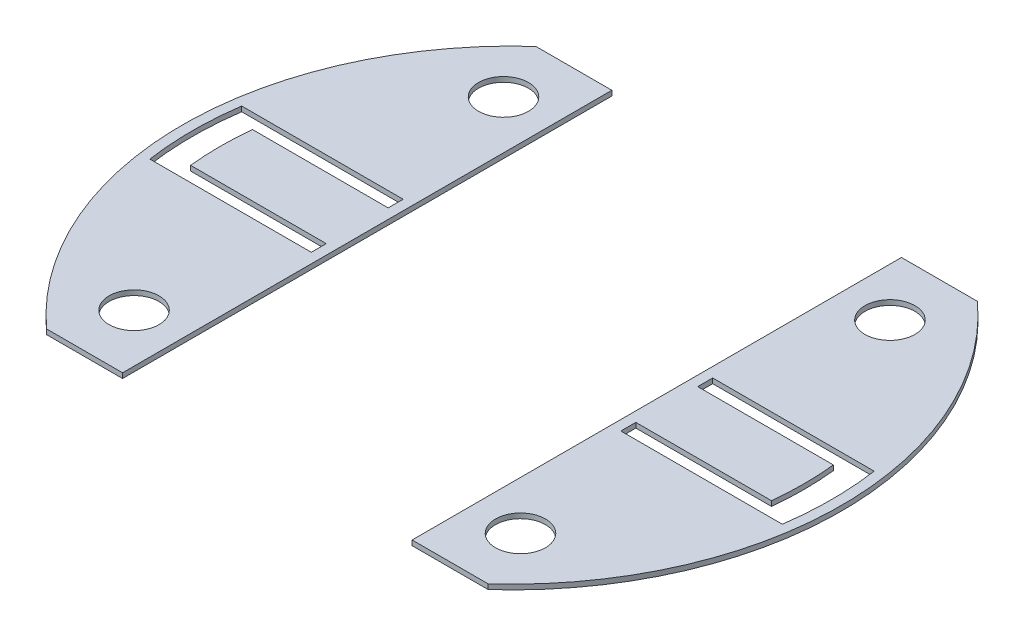
ISO-10303-21;
HEADER;
FILE_DESCRIPTION(('STEP AP214'),'2;1');
FILE_NAME('part.step','',(''),(''),'','','');
FILE_SCHEMA(('AUTOMOTIVE_DESIGN { 1 0 10303 214 1 1 1 1 }'));
ENDSEC;
DATA;
#1=APPLICATION_CONTEXT('core data for automotive mechanical design processes');
#2=APPLICATION_PROTOCOL_DEFINITION('international standard','automotive_design',2000,#1);
#3=PRODUCT_CONTEXT('',#1,'mechanical');
#4=PRODUCT('Part','Part','',(#3));
#5=PRODUCT_RELATED_PRODUCT_CATEGORY('part','',(#4));
#6=PRODUCT_DEFINITION_FORMATION('','',#4);
#7=PRODUCT_DEFINITION_CONTEXT('part definition',#1,'design');
#8=PRODUCT_DEFINITION('design','',#6,#7);
#9=PRODUCT_DEFINITION_SHAPE('','',#8);
#10=(LENGTH_UNIT() NAMED_UNIT(*) SI_UNIT(.MILLI.,.METRE.));
#11=(NAMED_UNIT(*) PLANE_ANGLE_UNIT() SI_UNIT($,.RADIAN.));
#12=(NAMED_UNIT(*) SI_UNIT($,.STERADIAN.) SOLID_ANGLE_UNIT());
#13=UNCERTAINTY_MEASURE_WITH_UNIT(LENGTH_MEASURE(1.E-05),#10,'distance_accuracy_value','');
#14=(GEOMETRIC_REPRESENTATION_CONTEXT(3) GLOBAL_UNCERTAINTY_ASSIGNED_CONTEXT((#13)) GLOBAL_UNIT_ASSIGNED_CONTEXT((#10,
#11,#12)) REPRESENTATION_CONTEXT('',''));
#15=CARTESIAN_POINT('',(0.,0.,0.));
#16=DIRECTION('',(0.,0.,1.));
#17=DIRECTION('',(1.,0.,0.));
#18=AXIS2_PLACEMENT_3D('',#15,#16,#17);
#19=CARTESIAN_POINT('',(0.,0.254,-12.446));
#20=DIRECTION('',(0.,0.,-1.));
#21=DIRECTION('',(-1.,0.,0.));
#22=AXIS2_PLACEMENT_3D('',#19,#20,#21);
#23=PLANE('',#22);
#24=DIRECTION('',(1.,0.,0.));
#25=VECTOR('',#24,1.);
#26=CARTESIAN_POINT('',(0.,0.,-12.446));
#27=LINE('',#26,#25);
#28=CARTESIAN_POINT('',(-11.2307070124725,0.,-12.446));
#29=VERTEX_POINT('',#28);
#30=CARTESIAN_POINT('',(-7.366,0.,-12.446));
#31=VERTEX_POINT('',#30);
#32=EDGE_CURVE('E194',#29,#31,#27,.T.);
#33=ORIENTED_EDGE('',*,*,#32,.F.);
#34=DIRECTION('',(0.,-1.,0.));
#35=VECTOR('',#34,1.);
#36=CARTESIAN_POINT('',(-11.2307070124725,0.254,-12.446));
#37=LINE('',#36,#35);
#38=CARTESIAN_POINT('',(-11.2307070124725,0.254,-12.446));
#39=VERTEX_POINT('',#38);
#40=EDGE_CURVE('E12',#39,#29,#37,.T.);
#41=ORIENTED_EDGE('',*,*,#40,.F.);
#42=DIRECTION('',(1.,0.,0.));
#43=VECTOR('',#42,1.);
#44=CARTESIAN_POINT('',(0.,0.254,-12.446));
#45=LINE('',#44,#43);
#46=CARTESIAN_POINT('',(-7.366,0.254,-12.446));
#47=VERTEX_POINT('',#46);
#48=EDGE_CURVE('E156',#39,#47,#45,.T.);
#49=ORIENTED_EDGE('',*,*,#48,.T.);
#50=DIRECTION('',(0.,-1.,0.));
#51=VECTOR('',#50,1.);
#52=CARTESIAN_POINT('',(-7.366,0.254,-12.446));
#53=LINE('',#52,#51);
#54=EDGE_CURVE('E66',#47,#31,#53,.T.);
#55=ORIENTED_EDGE('',*,*,#54,.T.);
#56=EDGE_LOOP('',(#33,#41,#49,#55));
#57=FACE_BOUND('',#56,.T.);
#58=ADVANCED_FACE('F47',(#57),#23,.T.);
#59=CARTESIAN_POINT('',(0.,0.254,0.));
#60=DIRECTION('',(0.,-1.,0.));
#61=DIRECTION('',(0.,0.,-1.));
#62=AXIS2_PLACEMENT_3D('',#59,#60,#61);
#63=CYLINDRICAL_SURFACE('',#62,16.764);
#64=CARTESIAN_POINT('',(0.,0.,0.));
#65=DIRECTION('',(0.,1.,0.));
#66=DIRECTION('',(0.,0.,1.));
#67=AXIS2_PLACEMENT_3D('',#64,#65,#66);
#68=CIRCLE('',#67,16.764);
#69=CARTESIAN_POINT('',(-11.2307070124725,0.,12.446));
#70=VERTEX_POINT('',#69);
#71=EDGE_CURVE('E161',#29,#70,#68,.T.);
#72=ORIENTED_EDGE('',*,*,#71,.T.);
#73=DIRECTION('',(0.,-1.,0.));
#74=VECTOR('',#73,1.);
#75=CARTESIAN_POINT('',(-11.2307070124725,0.254,12.446));
#76=LINE('',#75,#74);
#77=CARTESIAN_POINT('',(-11.2307070124725,0.254,12.446));
#78=VERTEX_POINT('',#77);
#79=EDGE_CURVE('E57',#78,#70,#76,.T.);
#80=ORIENTED_EDGE('',*,*,#79,.F.);
#81=CARTESIAN_POINT('',(0.,0.254,0.));
#82=DIRECTION('',(0.,1.,0.));
#83=DIRECTION('',(0.,0.,1.));
#84=AXIS2_PLACEMENT_3D('',#81,#82,#83);
#85=CIRCLE('',#84,16.764);
#86=EDGE_CURVE('E151',#39,#78,#85,.T.);
#87=ORIENTED_EDGE('',*,*,#86,.F.);
#88=ORIENTED_EDGE('',*,*,#40,.T.);
#89=EDGE_LOOP('',(#72,#80,#87,#88));
#90=FACE_BOUND('',#89,.T.);
#91=ADVANCED_FACE('F159',(#90),#63,.T.);
#92=CARTESIAN_POINT('',(0.,0.254,12.446));
#93=DIRECTION('',(0.,0.,-1.));
#94=DIRECTION('',(-1.,0.,0.));
#95=AXIS2_PLACEMENT_3D('',#92,#93,#94);
#96=PLANE('',#95);
#97=DIRECTION('',(1.,0.,0.));
#98=VECTOR('',#97,1.);
#99=CARTESIAN_POINT('',(0.,0.,12.446));
#100=LINE('',#99,#98);
#101=CARTESIAN_POINT('',(-7.366,0.,12.446));
#102=VERTEX_POINT('',#101);
#103=EDGE_CURVE('E191',#70,#102,#100,.T.);
#104=ORIENTED_EDGE('',*,*,#103,.T.);
#105=DIRECTION('',(0.,-1.,0.));
#106=VECTOR('',#105,1.);
#107=CARTESIAN_POINT('',(-7.366,0.254,12.446));
#108=LINE('',#107,#106);
#109=CARTESIAN_POINT('',(-7.366,0.254,12.446));
#110=VERTEX_POINT('',#109);
#111=EDGE_CURVE('E104',#110,#102,#108,.T.);
#112=ORIENTED_EDGE('',*,*,#111,.F.);
#113=DIRECTION('',(1.,0.,0.));
#114=VECTOR('',#113,1.);
#115=CARTESIAN_POINT('',(0.,0.254,12.446));
#116=LINE('',#115,#114);
#117=EDGE_CURVE('E143',#78,#110,#116,.T.);
#118=ORIENTED_EDGE('',*,*,#117,.F.);
#119=ORIENTED_EDGE('',*,*,#79,.T.);
#120=EDGE_LOOP('',(#104,#112,#118,#119));
#121=FACE_BOUND('',#120,.T.);
#122=ADVANCED_FACE('F145',(#121),#96,.F.);
#123=CARTESIAN_POINT('',(0.,0.254,0.));
#124=DIRECTION('',(0.,-1.,0.));
#125=DIRECTION('',(0.,0.,-1.));
#126=AXIS2_PLACEMENT_3D('',#123,#124,#125);
#127=CYLINDRICAL_SURFACE('',#126,14.859);
#128=CARTESIAN_POINT('',(0.,0.,0.));
#129=DIRECTION('',(0.,1.,0.));
#130=DIRECTION('',(0.,0.,1.));
#131=AXIS2_PLACEMENT_3D('',#128,#129,#130);
#132=CIRCLE('',#131,14.859);
#133=CARTESIAN_POINT('',(-14.7753133963378,0.,1.5748));
#134=VERTEX_POINT('',#133);
#135=CARTESIAN_POINT('',(-14.7753133963378,0.,-1.5748));
#136=VERTEX_POINT('',#135);
#137=EDGE_CURVE('E215',#134,#136,#132,.F.);
#138=ORIENTED_EDGE('',*,*,#137,.F.);
#139=DIRECTION('',(0.,-1.,0.));
#140=VECTOR('',#139,1.);
#141=CARTESIAN_POINT('',(-14.7753133963378,0.254,1.5748));
#142=LINE('',#141,#140);
#143=CARTESIAN_POINT('',(-14.7753133963378,0.254,1.5748));
#144=VERTEX_POINT('',#143);
#145=EDGE_CURVE('E51',#144,#134,#142,.T.);
#146=ORIENTED_EDGE('',*,*,#145,.F.);
#147=CARTESIAN_POINT('',(0.,0.254,0.));
#148=DIRECTION('',(0.,1.,0.));
#149=DIRECTION('',(0.,0.,1.));
#150=AXIS2_PLACEMENT_3D('',#147,#148,#149);
#151=CIRCLE('',#150,14.859);
#152=CARTESIAN_POINT('',(-14.7753133963378,0.254,-1.5748));
#153=VERTEX_POINT('',#152);
#154=EDGE_CURVE('E190',#144,#153,#151,.F.);
#155=ORIENTED_EDGE('',*,*,#154,.T.);
#156=DIRECTION('',(0.,-1.,0.));
#157=VECTOR('',#156,1.);
#158=CARTESIAN_POINT('',(-14.7753133963378,0.254,-1.5748));
#159=LINE('',#158,#157);
#160=EDGE_CURVE('E166',#153,#136,#159,.T.);
#161=ORIENTED_EDGE('',*,*,#160,.T.);
#162=EDGE_LOOP('',(#138,#146,#155,#161));
#163=FACE_BOUND('',#162,.T.);
#164=ADVANCED_FACE('F49',(#163),#127,.T.);
#165=CARTESIAN_POINT('',(0.,0.254,1.57479999999999));
#166=DIRECTION('',(0.,0.,1.));
#167=DIRECTION('',(1.,0.,0.));
#168=AXIS2_PLACEMENT_3D('',#165,#166,#167);
#169=PLANE('',#168);
#170=DIRECTION('',(-1.,0.,0.));
#171=VECTOR('',#170,1.);
#172=CARTESIAN_POINT('',(0.,0.,1.57479999999999));
#173=LINE('',#172,#171);
#174=CARTESIAN_POINT('',(-7.874,0.,1.5748));
#175=VERTEX_POINT('',#174);
#176=EDGE_CURVE('E212',#175,#134,#173,.T.);
#177=ORIENTED_EDGE('',*,*,#176,.F.);
#178=DIRECTION('',(0.,-1.,0.));
#179=VECTOR('',#178,1.);
#180=CARTESIAN_POINT('',(-7.874,0.254,1.5748));
#181=LINE('',#180,#179);
#182=CARTESIAN_POINT('',(-7.874,0.254,1.5748));
#183=VERTEX_POINT('',#182);
#184=EDGE_CURVE('E179',#183,#175,#181,.T.);
#185=ORIENTED_EDGE('',*,*,#184,.F.);
#186=DIRECTION('',(-1.,0.,0.));
#187=VECTOR('',#186,1.);
#188=CARTESIAN_POINT('',(0.,0.254,1.57479999999999));
#189=LINE('',#188,#187);
#190=EDGE_CURVE('E235',#183,#144,#189,.T.);
#191=ORIENTED_EDGE('',*,*,#190,.T.);
#192=ORIENTED_EDGE('',*,*,#145,.T.);
#193=EDGE_LOOP('',(#177,#185,#191,#192));
#194=FACE_BOUND('',#193,.T.);
#195=ADVANCED_FACE('F269',(#194),#169,.T.);
#196=CARTESIAN_POINT('',(-7.874,0.254,0.));
#197=DIRECTION('',(1.,0.,0.));
#198=DIRECTION('',(0.,0.,-1.));
#199=AXIS2_PLACEMENT_3D('',#196,#197,#198);
#200=PLANE('',#199);
#201=DIRECTION('',(0.,0.,1.));
#202=VECTOR('',#201,1.);
#203=CARTESIAN_POINT('',(-7.874,0.,0.));
#204=LINE('',#203,#202);
#205=CARTESIAN_POINT('',(-7.874,0.,2.3368));
#206=VERTEX_POINT('',#205);
#207=EDGE_CURVE('E210',#175,#206,#204,.T.);
#208=ORIENTED_EDGE('',*,*,#207,.T.);
#209=DIRECTION('',(0.,-1.,0.));
#210=VECTOR('',#209,1.);
#211=CARTESIAN_POINT('',(-7.874,0.254,2.3368));
#212=LINE('',#211,#210);
#213=CARTESIAN_POINT('',(-7.874,0.254,2.3368));
#214=VERTEX_POINT('',#213);
#215=EDGE_CURVE('E177',#214,#206,#212,.T.);
#216=ORIENTED_EDGE('',*,*,#215,.F.);
#217=DIRECTION('',(0.,0.,1.));
#218=VECTOR('',#217,1.);
#219=CARTESIAN_POINT('',(-7.874,0.254,0.));
#220=LINE('',#219,#218);
#221=EDGE_CURVE('E233',#183,#214,#220,.T.);
#222=ORIENTED_EDGE('',*,*,#221,.F.);
#223=ORIENTED_EDGE('',*,*,#184,.T.);
#224=EDGE_LOOP('',(#208,#216,#222,#223));
#225=FACE_BOUND('',#224,.T.);
#226=ADVANCED_FACE('F271',(#225),#200,.F.);
#227=CARTESIAN_POINT('',(0.,0.254,2.3368));
#228=DIRECTION('',(0.,0.,1.));
#229=DIRECTION('',(1.,0.,0.));
#230=AXIS2_PLACEMENT_3D('',#227,#228,#229);
#231=PLANE('',#230);
#232=DIRECTION('',(-1.,0.,0.));
#233=VECTOR('',#232,1.);
#234=CARTESIAN_POINT('',(0.,0.,2.3368));
#235=LINE('',#234,#233);
#236=CARTESIAN_POINT('',(-16.0871657466441,0.,2.3368));
#237=VERTEX_POINT('',#236);
#238=EDGE_CURVE('E207',#206,#237,#235,.T.);
#239=ORIENTED_EDGE('',*,*,#238,.T.);
#240=DIRECTION('',(0.,-1.,0.));
#241=VECTOR('',#240,1.);
#242=CARTESIAN_POINT('',(-16.0871657466441,0.254,2.3368));
#243=LINE('',#242,#241);
#244=CARTESIAN_POINT('',(-16.0871657466441,0.254,2.3368));
#245=VERTEX_POINT('',#244);
#246=EDGE_CURVE('E175',#245,#237,#243,.T.);
#247=ORIENTED_EDGE('',*,*,#246,.F.);
#248=DIRECTION('',(-1.,0.,0.));
#249=VECTOR('',#248,1.);
#250=CARTESIAN_POINT('',(0.,0.254,2.3368));
#251=LINE('',#250,#249);
#252=EDGE_CURVE('E231',#214,#245,#251,.T.);
#253=ORIENTED_EDGE('',*,*,#252,.F.);
#254=ORIENTED_EDGE('',*,*,#215,.T.);
#255=EDGE_LOOP('',(#239,#247,#253,#254));
#256=FACE_BOUND('',#255,.T.);
#257=ADVANCED_FACE('F277',(#256),#231,.F.);
#258=CARTESIAN_POINT('',(0.,0.254,0.));
#259=DIRECTION('',(0.,-1.,0.));
#260=DIRECTION('',(0.,0.,-1.));
#261=AXIS2_PLACEMENT_3D('',#258,#259,#260);
#262=CYLINDRICAL_SURFACE('',#261,16.256);
#263=CARTESIAN_POINT('',(0.,0.,0.));
#264=DIRECTION('',(0.,1.,0.));
#265=DIRECTION('',(0.,0.,1.));
#266=AXIS2_PLACEMENT_3D('',#263,#264,#265);
#267=CIRCLE('',#266,16.256);
#268=CARTESIAN_POINT('',(-16.0871657466441,0.,-2.33679999999999));
#269=VERTEX_POINT('',#268);
#270=EDGE_CURVE('E204',#269,#237,#267,.T.);
#271=ORIENTED_EDGE('',*,*,#270,.F.);
#272=DIRECTION('',(0.,-1.,0.));
#273=VECTOR('',#272,1.);
#274=CARTESIAN_POINT('',(-16.0871657466441,0.254,-2.33679999999999));
#275=LINE('',#274,#273);
#276=CARTESIAN_POINT('',(-16.0871657466441,0.254,-2.33679999999999));
#277=VERTEX_POINT('',#276);
#278=EDGE_CURVE('E173',#277,#269,#275,.T.);
#279=ORIENTED_EDGE('',*,*,#278,.F.);
#280=CARTESIAN_POINT('',(0.,0.254,0.));
#281=DIRECTION('',(0.,1.,0.));
#282=DIRECTION('',(0.,0.,1.));
#283=AXIS2_PLACEMENT_3D('',#280,#281,#282);
#284=CIRCLE('',#283,16.256);
#285=EDGE_CURVE('E228',#277,#245,#284,.T.);
#286=ORIENTED_EDGE('',*,*,#285,.T.);
#287=ORIENTED_EDGE('',*,*,#246,.T.);
#288=EDGE_LOOP('',(#271,#279,#286,#287));
#289=FACE_BOUND('',#288,.T.);
#290=ADVANCED_FACE('F281',(#289),#262,.F.);
#291=CARTESIAN_POINT('',(0.,0.254,-2.3368));
#292=DIRECTION('',(0.,0.,1.));
#293=DIRECTION('',(1.,0.,0.));
#294=AXIS2_PLACEMENT_3D('',#291,#292,#293);
#295=PLANE('',#294);
#296=DIRECTION('',(-1.,0.,0.));
#297=VECTOR('',#296,1.);
#298=CARTESIAN_POINT('',(0.,0.,-2.3368));
#299=LINE('',#298,#297);
#300=CARTESIAN_POINT('',(-7.874,0.,-2.3368));
#301=VERTEX_POINT('',#300);
#302=EDGE_CURVE('E201',#301,#269,#299,.T.);
#303=ORIENTED_EDGE('',*,*,#302,.F.);
#304=DIRECTION('',(0.,-1.,0.));
#305=VECTOR('',#304,1.);
#306=CARTESIAN_POINT('',(-7.874,0.254,-2.3368));
#307=LINE('',#306,#305);
#308=CARTESIAN_POINT('',(-7.874,0.254,-2.3368));
#309=VERTEX_POINT('',#308);
#310=EDGE_CURVE('E171',#309,#301,#307,.T.);
#311=ORIENTED_EDGE('',*,*,#310,.F.);
#312=DIRECTION('',(-1.,0.,0.));
#313=VECTOR('',#312,1.);
#314=CARTESIAN_POINT('',(0.,0.254,-2.3368));
#315=LINE('',#314,#313);
#316=EDGE_CURVE('E225',#309,#277,#315,.T.);
#317=ORIENTED_EDGE('',*,*,#316,.T.);
#318=ORIENTED_EDGE('',*,*,#278,.T.);
#319=EDGE_LOOP('',(#303,#311,#317,#318));
#320=FACE_BOUND('',#319,.T.);
#321=ADVANCED_FACE('F284',(#320),#295,.T.);
#322=CARTESIAN_POINT('',(-7.874,0.254,0.));
#323=DIRECTION('',(1.,0.,0.));
#324=DIRECTION('',(0.,0.,-1.));
#325=AXIS2_PLACEMENT_3D('',#322,#323,#324);
#326=PLANE('',#325);
#327=DIRECTION('',(0.,0.,1.));
#328=VECTOR('',#327,1.);
#329=CARTESIAN_POINT('',(-7.874,0.,0.));
#330=LINE('',#329,#328);
#331=CARTESIAN_POINT('',(-7.874,0.,-1.57479999999999));
#332=VERTEX_POINT('',#331);
#333=EDGE_CURVE('E199',#301,#332,#330,.T.);
#334=ORIENTED_EDGE('',*,*,#333,.T.);
#335=DIRECTION('',(0.,-1.,0.));
#336=VECTOR('',#335,1.);
#337=CARTESIAN_POINT('',(-7.874,0.254,-1.57479999999999));
#338=LINE('',#337,#336);
#339=CARTESIAN_POINT('',(-7.874,0.254,-1.57479999999999));
#340=VERTEX_POINT('',#339);
#341=EDGE_CURVE('E168',#340,#332,#338,.T.);
#342=ORIENTED_EDGE('',*,*,#341,.F.);
#343=DIRECTION('',(0.,0.,1.));
#344=VECTOR('',#343,1.);
#345=CARTESIAN_POINT('',(-7.874,0.254,0.));
#346=LINE('',#345,#344);
#347=EDGE_CURVE('E223',#309,#340,#346,.T.);
#348=ORIENTED_EDGE('',*,*,#347,.F.);
#349=ORIENTED_EDGE('',*,*,#310,.T.);
#350=EDGE_LOOP('',(#334,#342,#348,#349));
#351=FACE_BOUND('',#350,.T.);
#352=ADVANCED_FACE('F288',(#351),#326,.F.);
#353=CARTESIAN_POINT('',(0.,0.254,-1.57479999999999));
#354=DIRECTION('',(0.,0.,1.));
#355=DIRECTION('',(1.,0.,0.));
#356=AXIS2_PLACEMENT_3D('',#353,#354,#355);
#357=PLANE('',#356);
#358=DIRECTION('',(-1.,0.,0.));
#359=VECTOR('',#358,1.);
#360=CARTESIAN_POINT('',(0.,0.,-1.57479999999999));
#361=LINE('',#360,#359);
#362=EDGE_CURVE('E196',#332,#136,#361,.T.);
#363=ORIENTED_EDGE('',*,*,#362,.T.);
#364=ORIENTED_EDGE('',*,*,#160,.F.);
#365=DIRECTION('',(-1.,0.,0.));
#366=VECTOR('',#365,1.);
#367=CARTESIAN_POINT('',(0.,0.254,-1.57479999999999));
#368=LINE('',#367,#366);
#369=EDGE_CURVE('E221',#340,#153,#368,.T.);
#370=ORIENTED_EDGE('',*,*,#369,.F.);
#371=ORIENTED_EDGE('',*,*,#341,.T.);
#372=EDGE_LOOP('',(#363,#364,#370,#371));
#373=FACE_BOUND('',#372,.T.);
#374=ADVANCED_FACE('F292',(#373),#357,.F.);
#375=CARTESIAN_POINT('',(-7.366,0.254,0.));
#376=DIRECTION('',(1.,0.,0.));
#377=DIRECTION('',(0.,0.,-1.));
#378=AXIS2_PLACEMENT_3D('',#375,#376,#377);
#379=PLANE('',#378);
#380=DIRECTION('',(0.,0.,1.));
#381=VECTOR('',#380,1.);
#382=CARTESIAN_POINT('',(-7.366,0.,0.));
#383=LINE('',#382,#381);
#384=EDGE_CURVE('E187',#31,#102,#383,.T.);
#385=ORIENTED_EDGE('',*,*,#384,.F.);
#386=ORIENTED_EDGE('',*,*,#54,.F.);
#387=DIRECTION('',(0.,0.,1.));
#388=VECTOR('',#387,1.);
#389=CARTESIAN_POINT('',(-7.366,0.254,0.));
#390=LINE('',#389,#388);
#391=EDGE_CURVE('E150',#47,#110,#390,.T.);
#392=ORIENTED_EDGE('',*,*,#391,.T.);
#393=ORIENTED_EDGE('',*,*,#111,.T.);
#394=EDGE_LOOP('',(#385,#386,#392,#393));
#395=FACE_BOUND('',#394,.T.);
#396=ADVANCED_FACE('F262',(#395),#379,.T.);
#397=CARTESIAN_POINT('',(0.,0.254,0.));
#398=DIRECTION('',(0.,1.,0.));
#399=DIRECTION('',(0.,0.,1.));
#400=AXIS2_PLACEMENT_3D('',#397,#398,#399);
#401=PLANE('',#400);
#402=CARTESIAN_POINT('',(-9.8298,0.254,9.39799999999999));
#403=DIRECTION('',(0.,1.,0.));
#404=DIRECTION('',(0.,0.,1.));
#405=AXIS2_PLACEMENT_3D('',#402,#403,#404);
#406=CIRCLE('',#405,1.27);
#407=CARTESIAN_POINT('',(-9.8298,0.254,10.668));
#408=VERTEX_POINT('',#407);
#409=EDGE_CURVE('E244',#408,#408,#406,.T.);
#410=ORIENTED_EDGE('',*,*,#409,.F.);
#411=EDGE_LOOP('',(#410));
#412=FACE_BOUND('',#411,.T.);
#413=CARTESIAN_POINT('',(-9.8298,0.254,-9.39800000000001));
#414=DIRECTION('',(0.,1.,0.));
#415=DIRECTION('',(0.,0.,1.));
#416=AXIS2_PLACEMENT_3D('',#413,#414,#415);
#417=CIRCLE('',#416,1.27);
#418=CARTESIAN_POINT('',(-9.8298,0.254,-8.128));
#419=VERTEX_POINT('',#418);
#420=EDGE_CURVE('E238',#419,#419,#417,.T.);
#421=ORIENTED_EDGE('',*,*,#420,.F.);
#422=EDGE_LOOP('',(#421));
#423=FACE_BOUND('',#422,.T.);
#424=ORIENTED_EDGE('',*,*,#154,.F.);
#425=ORIENTED_EDGE('',*,*,#190,.F.);
#426=ORIENTED_EDGE('',*,*,#221,.T.);
#427=ORIENTED_EDGE('',*,*,#252,.T.);
#428=ORIENTED_EDGE('',*,*,#285,.F.);
#429=ORIENTED_EDGE('',*,*,#316,.F.);
#430=ORIENTED_EDGE('',*,*,#347,.T.);
#431=ORIENTED_EDGE('',*,*,#369,.T.);
#432=EDGE_LOOP('',(#424,#425,#426,#427,#428,#429,#430,#431));
#433=FACE_BOUND('',#432,.T.);
#434=ORIENTED_EDGE('',*,*,#48,.F.);
#435=ORIENTED_EDGE('',*,*,#86,.T.);
#436=ORIENTED_EDGE('',*,*,#117,.T.);
#437=ORIENTED_EDGE('',*,*,#391,.F.);
#438=EDGE_LOOP('',(#434,#435,#436,#437));
#439=FACE_BOUND('',#438,.T.);
#440=ADVANCED_FACE('F155',(#412,#423,#433,#439),#401,.T.);
#441=CARTESIAN_POINT('',(0.,0.,0.));
#442=DIRECTION('',(0.,1.,0.));
#443=DIRECTION('',(0.,0.,1.));
#444=AXIS2_PLACEMENT_3D('',#441,#442,#443);
#445=PLANE('',#444);
#446=CARTESIAN_POINT('',(-9.8298,0.,9.39799999999999));
#447=DIRECTION('',(0.,1.,0.));
#448=DIRECTION('',(0.,0.,1.));
#449=AXIS2_PLACEMENT_3D('',#446,#447,#448);
#450=CIRCLE('',#449,1.27);
#451=CARTESIAN_POINT('',(-9.8298,0.,10.668));
#452=VERTEX_POINT('',#451);
#453=EDGE_CURVE('E218',#452,#452,#450,.T.);
#454=ORIENTED_EDGE('',*,*,#453,.T.);
#455=EDGE_LOOP('',(#454));
#456=FACE_BOUND('',#455,.T.);
#457=CARTESIAN_POINT('',(-9.8298,0.,-9.39800000000001));
#458=DIRECTION('',(0.,1.,0.));
#459=DIRECTION('',(0.,0.,1.));
#460=AXIS2_PLACEMENT_3D('',#457,#458,#459);
#461=CIRCLE('',#460,1.27);
#462=CARTESIAN_POINT('',(-9.8298,0.,-8.128));
#463=VERTEX_POINT('',#462);
#464=EDGE_CURVE('E241',#463,#463,#461,.T.);
#465=ORIENTED_EDGE('',*,*,#464,.T.);
#466=EDGE_LOOP('',(#465));
#467=FACE_BOUND('',#466,.T.);
#468=ORIENTED_EDGE('',*,*,#137,.T.);
#469=ORIENTED_EDGE('',*,*,#362,.F.);
#470=ORIENTED_EDGE('',*,*,#333,.F.);
#471=ORIENTED_EDGE('',*,*,#302,.T.);
#472=ORIENTED_EDGE('',*,*,#270,.T.);
#473=ORIENTED_EDGE('',*,*,#238,.F.);
#474=ORIENTED_EDGE('',*,*,#207,.F.);
#475=ORIENTED_EDGE('',*,*,#176,.T.);
#476=EDGE_LOOP('',(#468,#469,#470,#471,#472,#473,#474,#475));
#477=FACE_BOUND('',#476,.T.);
#478=ORIENTED_EDGE('',*,*,#32,.T.);
#479=ORIENTED_EDGE('',*,*,#384,.T.);
#480=ORIENTED_EDGE('',*,*,#103,.F.);
#481=ORIENTED_EDGE('',*,*,#71,.F.);
#482=EDGE_LOOP('',(#478,#479,#480,#481));
#483=FACE_BOUND('',#482,.T.);
#484=ADVANCED_FACE('F250',(#456,#467,#477,#483),#445,.F.);
#485=CARTESIAN_POINT('',(-9.8298,0.,-9.39800000000001));
#486=DIRECTION('',(0.,1.,0.));
#487=DIRECTION('',(0.,0.,1.));
#488=AXIS2_PLACEMENT_3D('',#485,#486,#487);
#489=CYLINDRICAL_SURFACE('',#488,1.27);
#490=ORIENTED_EDGE('',*,*,#464,.F.);
#491=EDGE_LOOP('',(#490));
#492=FACE_BOUND('',#491,.T.);
#493=ORIENTED_EDGE('',*,*,#420,.T.);
#494=EDGE_LOOP('',(#493));
#495=FACE_BOUND('',#494,.T.);
#496=ADVANCED_FACE('F256',(#492,#495),#489,.F.);
#497=CARTESIAN_POINT('',(-9.8298,0.,9.39799999999999));
#498=DIRECTION('',(0.,1.,0.));
#499=DIRECTION('',(0.,0.,1.));
#500=AXIS2_PLACEMENT_3D('',#497,#498,#499);
#501=CYLINDRICAL_SURFACE('',#500,1.27);
#502=ORIENTED_EDGE('',*,*,#453,.F.);
#503=EDGE_LOOP('',(#502));
#504=FACE_BOUND('',#503,.T.);
#505=ORIENTED_EDGE('',*,*,#409,.T.);
#506=EDGE_LOOP('',(#505));
#507=FACE_BOUND('',#506,.T.);
#508=ADVANCED_FACE('F253',(#504,#507),#501,.F.);
#509=CLOSED_SHELL('',(#58,#91,#122,#164,#195,#226,#257,#290,#321,#352,#374,#396,#440,#484,#496,#508));
#510=MANIFOLD_SOLID_BREP('B2',#509);
#511=CARTESIAN_POINT('',(0.,0.254,1.5748));
#512=DIRECTION('',(0.,0.,-1.));
#513=DIRECTION('',(-1.,0.,0.));
#514=AXIS2_PLACEMENT_3D('',#511,#512,#513);
#515=PLANE('',#514);
#516=DIRECTION('',(1.,0.,0.));
#517=VECTOR('',#516,1.);
#518=CARTESIAN_POINT('',(0.,0.,1.5748));
#519=LINE('',#518,#517);
#520=CARTESIAN_POINT('',(7.874,0.,1.5748));
#521=VERTEX_POINT('',#520);
#522=CARTESIAN_POINT('',(14.7753133963378,0.,1.5748));
#523=VERTEX_POINT('',#522);
#524=EDGE_CURVE('E560',#521,#523,#519,.T.);
#525=ORIENTED_EDGE('',*,*,#524,.T.);
#526=DIRECTION('',(0.,-1.,0.));
#527=VECTOR('',#526,1.);
#528=CARTESIAN_POINT('',(14.7753133963378,0.254,1.5748));
#529=LINE('',#528,#527);
#530=CARTESIAN_POINT('',(14.7753133963378,0.254,1.5748));
#531=VERTEX_POINT('',#530);
#532=EDGE_CURVE('E45',#531,#523,#529,.T.);
#533=ORIENTED_EDGE('',*,*,#532,.F.);
#534=DIRECTION('',(1.,0.,0.));
#535=VECTOR('',#534,1.);
#536=CARTESIAN_POINT('',(0.,0.254,1.5748));
#537=LINE('',#536,#535);
#538=CARTESIAN_POINT('',(7.874,0.254,1.5748));
#539=VERTEX_POINT('',#538);
#540=EDGE_CURVE('E617',#539,#531,#537,.T.);
#541=ORIENTED_EDGE('',*,*,#540,.F.);
#542=DIRECTION('',(0.,-1.,0.));
#543=VECTOR('',#542,1.);
#544=CARTESIAN_POINT('',(7.874,0.254,1.5748));
#545=LINE('',#544,#543);
#546=EDGE_CURVE('E442',#539,#521,#545,.T.);
#547=ORIENTED_EDGE('',*,*,#546,.T.);
#548=EDGE_LOOP('',(#525,#533,#541,#547));
#549=FACE_BOUND('',#548,.T.);
#550=ADVANCED_FACE('F423',(#549),#515,.F.);
#551=CARTESIAN_POINT('',(0.,0.254,0.));
#552=DIRECTION('',(0.,-1.,0.));
#553=DIRECTION('',(0.,0.,-1.));
#554=AXIS2_PLACEMENT_3D('',#551,#552,#553);
#555=CYLINDRICAL_SURFACE('',#554,14.859);
#556=CARTESIAN_POINT('',(0.,0.,0.));
#557=DIRECTION('',(0.,1.,0.));
#558=DIRECTION('',(0.,0.,1.));
#559=AXIS2_PLACEMENT_3D('',#556,#557,#558);
#560=CIRCLE('',#559,14.859);
#561=CARTESIAN_POINT('',(14.7753133963378,0.,-1.5748));
#562=VERTEX_POINT('',#561);
#563=EDGE_CURVE('E562',#523,#562,#560,.T.);
#564=ORIENTED_EDGE('',*,*,#563,.T.);
#565=DIRECTION('',(0.,-1.,0.));
#566=VECTOR('',#565,1.);
#567=CARTESIAN_POINT('',(14.7753133963378,0.254,-1.5748));
#568=LINE('',#567,#566);
#569=CARTESIAN_POINT('',(14.7753133963378,0.254,-1.5748));
#570=VERTEX_POINT('',#569);
#571=EDGE_CURVE('E433',#570,#562,#568,.T.);
#572=ORIENTED_EDGE('',*,*,#571,.F.);
#573=CARTESIAN_POINT('',(0.,0.254,0.));
#574=DIRECTION('',(0.,1.,0.));
#575=DIRECTION('',(0.,0.,1.));
#576=AXIS2_PLACEMENT_3D('',#573,#574,#575);
#577=CIRCLE('',#576,14.859);
#578=EDGE_CURVE('E623',#531,#570,#577,.T.);
#579=ORIENTED_EDGE('',*,*,#578,.F.);
#580=ORIENTED_EDGE('',*,*,#532,.T.);
#581=EDGE_LOOP('',(#564,#572,#579,#580));
#582=FACE_BOUND('',#581,.T.);
#583=ADVANCED_FACE('F650',(#582),#555,.T.);
#584=CARTESIAN_POINT('',(0.,0.254,-1.5748));
#585=DIRECTION('',(0.,0.,-1.));
#586=DIRECTION('',(-1.,0.,0.));
#587=AXIS2_PLACEMENT_3D('',#584,#585,#586);
#588=PLANE('',#587);
#589=DIRECTION('',(1.,0.,0.));
#590=VECTOR('',#589,1.);
#591=CARTESIAN_POINT('',(0.,0.,-1.5748));
#592=LINE('',#591,#590);
#593=CARTESIAN_POINT('',(7.874,0.,-1.5748));
#594=VERTEX_POINT('',#593);
#595=EDGE_CURVE('E565',#594,#562,#592,.T.);
#596=ORIENTED_EDGE('',*,*,#595,.F.);
#597=DIRECTION('',(0.,-1.,0.));
#598=VECTOR('',#597,1.);
#599=CARTESIAN_POINT('',(7.874,0.254,-1.5748));
#600=LINE('',#599,#598);
#601=CARTESIAN_POINT('',(7.874,0.254,-1.5748));
#602=VERTEX_POINT('',#601);
#603=EDGE_CURVE('E586',#602,#594,#600,.T.);
#604=ORIENTED_EDGE('',*,*,#603,.F.);
#605=DIRECTION('',(1.,0.,0.));
#606=VECTOR('',#605,1.);
#607=CARTESIAN_POINT('',(0.,0.254,-1.5748));
#608=LINE('',#607,#606);
#609=EDGE_CURVE('E625',#602,#570,#608,.T.);
#610=ORIENTED_EDGE('',*,*,#609,.T.);
#611=ORIENTED_EDGE('',*,*,#571,.T.);
#612=EDGE_LOOP('',(#596,#604,#610,#611));
#613=FACE_BOUND('',#612,.T.);
#614=ADVANCED_FACE('F637',(#613),#588,.T.);
#615=CARTESIAN_POINT('',(7.874,0.254,0.));
#616=DIRECTION('',(1.,0.,0.));
#617=DIRECTION('',(0.,0.,-1.));
#618=AXIS2_PLACEMENT_3D('',#615,#616,#617);
#619=PLANE('',#618);
#620=DIRECTION('',(0.,0.,1.));
#621=VECTOR('',#620,1.);
#622=CARTESIAN_POINT('',(7.874,0.,0.));
#623=LINE('',#622,#621);
#624=CARTESIAN_POINT('',(7.874,0.,-2.3368));
#625=VERTEX_POINT('',#624);
#626=EDGE_CURVE('E568',#625,#594,#623,.T.);
#627=ORIENTED_EDGE('',*,*,#626,.F.);
#628=DIRECTION('',(0.,-1.,0.));
#629=VECTOR('',#628,1.);
#630=CARTESIAN_POINT('',(7.874,0.254,-2.3368));
#631=LINE('',#630,#629);
#632=CARTESIAN_POINT('',(7.874,0.254,-2.3368));
#633=VERTEX_POINT('',#632);
#634=EDGE_CURVE('E584',#633,#625,#631,.T.);
#635=ORIENTED_EDGE('',*,*,#634,.F.);
#636=DIRECTION('',(0.,0.,1.));
#637=VECTOR('',#636,1.);
#638=CARTESIAN_POINT('',(7.874,0.254,0.));
#639=LINE('',#638,#637);
#640=EDGE_CURVE('E628',#633,#602,#639,.T.);
#641=ORIENTED_EDGE('',*,*,#640,.T.);
#642=ORIENTED_EDGE('',*,*,#603,.T.);
#643=EDGE_LOOP('',(#627,#635,#641,#642));
#644=FACE_BOUND('',#643,.T.);
#645=ADVANCED_FACE('F632',(#644),#619,.T.);
#646=CARTESIAN_POINT('',(0.,0.254,-2.3368));
#647=DIRECTION('',(0.,0.,-1.));
#648=DIRECTION('',(-1.,0.,0.));
#649=AXIS2_PLACEMENT_3D('',#646,#647,#648);
#650=PLANE('',#649);
#651=DIRECTION('',(1.,0.,0.));
#652=VECTOR('',#651,1.);
#653=CARTESIAN_POINT('',(0.,0.,-2.3368));
#654=LINE('',#653,#652);
#655=CARTESIAN_POINT('',(16.0871657466441,0.,-2.3368));
#656=VERTEX_POINT('',#655);
#657=EDGE_CURVE('E571',#625,#656,#654,.T.);
#658=ORIENTED_EDGE('',*,*,#657,.T.);
#659=DIRECTION('',(0.,-1.,0.));
#660=VECTOR('',#659,1.);
#661=CARTESIAN_POINT('',(16.0871657466441,0.254,-2.3368));
#662=LINE('',#661,#660);
#663=CARTESIAN_POINT('',(16.0871657466441,0.254,-2.3368));
#664=VERTEX_POINT('',#663);
#665=EDGE_CURVE('E529',#664,#656,#662,.T.);
#666=ORIENTED_EDGE('',*,*,#665,.F.);
#667=DIRECTION('',(1.,0.,0.));
#668=VECTOR('',#667,1.);
#669=CARTESIAN_POINT('',(0.,0.254,-2.3368));
#670=LINE('',#669,#668);
#671=EDGE_CURVE('E539',#633,#664,#670,.T.);
#672=ORIENTED_EDGE('',*,*,#671,.F.);
#673=ORIENTED_EDGE('',*,*,#634,.T.);
#674=EDGE_LOOP('',(#658,#666,#672,#673));
#675=FACE_BOUND('',#674,.T.);
#676=ADVANCED_FACE('F640',(#675),#650,.F.);
#677=CARTESIAN_POINT('',(0.,0.254,0.));
#678=DIRECTION('',(0.,-1.,0.));
#679=DIRECTION('',(0.,0.,-1.));
#680=AXIS2_PLACEMENT_3D('',#677,#678,#679);
#681=CYLINDRICAL_SURFACE('',#680,16.256);
#682=CARTESIAN_POINT('',(0.,0.,0.));
#683=DIRECTION('',(0.,1.,0.));
#684=DIRECTION('',(0.,0.,1.));
#685=AXIS2_PLACEMENT_3D('',#682,#683,#684);
#686=CIRCLE('',#685,16.256);
#687=CARTESIAN_POINT('',(16.0871657466441,0.,2.33679999999999));
#688=VERTEX_POINT('',#687);
#689=EDGE_CURVE('E525',#688,#656,#686,.T.);
#690=ORIENTED_EDGE('',*,*,#689,.F.);
#691=DIRECTION('',(0.,-1.,0.));
#692=VECTOR('',#691,1.);
#693=CARTESIAN_POINT('',(16.0871657466441,0.254,2.33679999999999));
#694=LINE('',#693,#692);
#695=CARTESIAN_POINT('',(16.0871657466441,0.254,2.33679999999999));
#696=VERTEX_POINT('',#695);
#697=EDGE_CURVE('E520',#696,#688,#694,.T.);
#698=ORIENTED_EDGE('',*,*,#697,.F.);
#699=CARTESIAN_POINT('',(0.,0.254,0.));
#700=DIRECTION('',(0.,1.,0.));
#701=DIRECTION('',(0.,0.,1.));
#702=AXIS2_PLACEMENT_3D('',#699,#700,#701);
#703=CIRCLE('',#702,16.256);
#704=EDGE_CURVE('E523',#696,#664,#703,.T.);
#705=ORIENTED_EDGE('',*,*,#704,.T.);
#706=ORIENTED_EDGE('',*,*,#665,.T.);
#707=EDGE_LOOP('',(#690,#698,#705,#706));
#708=FACE_BOUND('',#707,.T.);
#709=ADVANCED_FACE('F522',(#708),#681,.F.);
#710=CARTESIAN_POINT('',(0.,0.254,2.33680000000001));
#711=DIRECTION('',(0.,0.,-1.));
#712=DIRECTION('',(-1.,0.,0.));
#713=AXIS2_PLACEMENT_3D('',#710,#711,#712);
#714=PLANE('',#713);
#715=DIRECTION('',(1.,0.,0.));
#716=VECTOR('',#715,1.);
#717=CARTESIAN_POINT('',(0.,0.,2.33680000000001));
#718=LINE('',#717,#716);
#719=CARTESIAN_POINT('',(7.874,0.,2.3368));
#720=VERTEX_POINT('',#719);
#721=EDGE_CURVE('E575',#720,#688,#718,.T.);
#722=ORIENTED_EDGE('',*,*,#721,.F.);
#723=DIRECTION('',(0.,-1.,0.));
#724=VECTOR('',#723,1.);
#725=CARTESIAN_POINT('',(7.874,0.254,2.3368));
#726=LINE('',#725,#724);
#727=CARTESIAN_POINT('',(7.874,0.254,2.3368));
#728=VERTEX_POINT('',#727);
#729=EDGE_CURVE('E480',#728,#720,#726,.T.);
#730=ORIENTED_EDGE('',*,*,#729,.F.);
#731=DIRECTION('',(1.,0.,0.));
#732=VECTOR('',#731,1.);
#733=CARTESIAN_POINT('',(0.,0.254,2.33680000000001));
#734=LINE('',#733,#732);
#735=EDGE_CURVE('E536',#728,#696,#734,.T.);
#736=ORIENTED_EDGE('',*,*,#735,.T.);
#737=ORIENTED_EDGE('',*,*,#697,.T.);
#738=EDGE_LOOP('',(#722,#730,#736,#737));
#739=FACE_BOUND('',#738,.T.);
#740=ADVANCED_FACE('F542',(#739),#714,.T.);
#741=CARTESIAN_POINT('',(0.,0.254,12.446));
#742=DIRECTION('',(0.,0.,1.));
#743=DIRECTION('',(1.,0.,0.));
#744=AXIS2_PLACEMENT_3D('',#741,#742,#743);
#745=PLANE('',#744);
#746=DIRECTION('',(-1.,0.,0.));
#747=VECTOR('',#746,1.);
#748=CARTESIAN_POINT('',(0.,0.,12.446));
#749=LINE('',#748,#747);
#750=CARTESIAN_POINT('',(11.2307070124725,0.,12.446));
#751=VERTEX_POINT('',#750);
#752=CARTESIAN_POINT('',(7.366,0.,12.446));
#753=VERTEX_POINT('',#752);
#754=EDGE_CURVE('E549',#751,#753,#749,.T.);
#755=ORIENTED_EDGE('',*,*,#754,.F.);
#756=DIRECTION('',(0.,-1.,0.));
#757=VECTOR('',#756,1.);
#758=CARTESIAN_POINT('',(11.2307070124725,0.254,12.446));
#759=LINE('',#758,#757);
#760=CARTESIAN_POINT('',(11.2307070124725,0.254,12.446));
#761=VERTEX_POINT('',#760);
#762=EDGE_CURVE('E427',#761,#751,#759,.T.);
#763=ORIENTED_EDGE('',*,*,#762,.F.);
#764=DIRECTION('',(-1.,0.,0.));
#765=VECTOR('',#764,1.);
#766=CARTESIAN_POINT('',(0.,0.254,12.446));
#767=LINE('',#766,#765);
#768=CARTESIAN_POINT('',(7.366,0.254,12.446));
#769=VERTEX_POINT('',#768);
#770=EDGE_CURVE('E580',#761,#769,#767,.T.);
#771=ORIENTED_EDGE('',*,*,#770,.T.);
#772=DIRECTION('',(0.,-1.,0.));
#773=VECTOR('',#772,1.);
#774=CARTESIAN_POINT('',(7.366,0.254,12.446));
#775=LINE('',#774,#773);
#776=EDGE_CURVE('E545',#769,#753,#775,.T.);
#777=ORIENTED_EDGE('',*,*,#776,.T.);
#778=EDGE_LOOP('',(#755,#763,#771,#777));
#779=FACE_BOUND('',#778,.T.);
#780=ADVANCED_FACE('F425',(#779),#745,.T.);
#781=CARTESIAN_POINT('',(0.,0.254,0.));
#782=DIRECTION('',(0.,-1.,0.));
#783=DIRECTION('',(0.,0.,-1.));
#784=AXIS2_PLACEMENT_3D('',#781,#782,#783);
#785=CYLINDRICAL_SURFACE('',#784,16.764);
#786=CARTESIAN_POINT('',(0.,0.,0.));
#787=DIRECTION('',(0.,1.,0.));
#788=DIRECTION('',(0.,0.,1.));
#789=AXIS2_PLACEMENT_3D('',#786,#787,#788);
#790=CIRCLE('',#789,16.764);
#791=CARTESIAN_POINT('',(11.2307070124725,0.,-12.446));
#792=VERTEX_POINT('',#791);
#793=EDGE_CURVE('E552',#751,#792,#790,.T.);
#794=ORIENTED_EDGE('',*,*,#793,.T.);
#795=DIRECTION('',(0.,-1.,0.));
#796=VECTOR('',#795,1.);
#797=CARTESIAN_POINT('',(11.2307070124725,0.254,-12.446));
#798=LINE('',#797,#796);
#799=CARTESIAN_POINT('',(11.2307070124725,0.254,-12.446));
#800=VERTEX_POINT('',#799);
#801=EDGE_CURVE('E592',#800,#792,#798,.T.);
#802=ORIENTED_EDGE('',*,*,#801,.F.);
#803=CARTESIAN_POINT('',(0.,0.254,0.));
#804=DIRECTION('',(0.,1.,0.));
#805=DIRECTION('',(0.,0.,1.));
#806=AXIS2_PLACEMENT_3D('',#803,#804,#805);
#807=CIRCLE('',#806,16.764);
#808=EDGE_CURVE('E601',#761,#800,#807,.T.);
#809=ORIENTED_EDGE('',*,*,#808,.F.);
#810=ORIENTED_EDGE('',*,*,#762,.T.);
#811=EDGE_LOOP('',(#794,#802,#809,#810));
#812=FACE_BOUND('',#811,.T.);
#813=ADVANCED_FACE('F600',(#812),#785,.T.);
#814=CARTESIAN_POINT('',(0.,0.254,-12.446));
#815=DIRECTION('',(0.,0.,1.));
#816=DIRECTION('',(1.,0.,0.));
#817=AXIS2_PLACEMENT_3D('',#814,#815,#816);
#818=PLANE('',#817);
#819=DIRECTION('',(-1.,0.,0.));
#820=VECTOR('',#819,1.);
#821=CARTESIAN_POINT('',(0.,0.,-12.446));
#822=LINE('',#821,#820);
#823=CARTESIAN_POINT('',(7.366,0.,-12.446));
#824=VERTEX_POINT('',#823);
#825=EDGE_CURVE('E555',#792,#824,#822,.T.);
#826=ORIENTED_EDGE('',*,*,#825,.T.);
#827=DIRECTION('',(0.,-1.,0.));
#828=VECTOR('',#827,1.);
#829=CARTESIAN_POINT('',(7.366,0.254,-12.446));
#830=LINE('',#829,#828);
#831=CARTESIAN_POINT('',(7.366,0.254,-12.446));
#832=VERTEX_POINT('',#831);
#833=EDGE_CURVE('E590',#832,#824,#830,.T.);
#834=ORIENTED_EDGE('',*,*,#833,.F.);
#835=DIRECTION('',(-1.,0.,0.));
#836=VECTOR('',#835,1.);
#837=CARTESIAN_POINT('',(0.,0.254,-12.446));
#838=LINE('',#837,#836);
#839=EDGE_CURVE('E614',#800,#832,#838,.T.);
#840=ORIENTED_EDGE('',*,*,#839,.F.);
#841=ORIENTED_EDGE('',*,*,#801,.T.);
#842=EDGE_LOOP('',(#826,#834,#840,#841));
#843=FACE_BOUND('',#842,.T.);
#844=ADVANCED_FACE('F613',(#843),#818,.F.);
#845=CARTESIAN_POINT('',(7.366,0.254,0.));
#846=DIRECTION('',(1.,0.,0.));
#847=DIRECTION('',(0.,0.,-1.));
#848=AXIS2_PLACEMENT_3D('',#845,#846,#847);
#849=PLANE('',#848);
#850=DIRECTION('',(0.,0.,1.));
#851=VECTOR('',#850,1.);
#852=CARTESIAN_POINT('',(7.366,0.,0.));
#853=LINE('',#852,#851);
#854=EDGE_CURVE('E557',#824,#753,#853,.T.);
#855=ORIENTED_EDGE('',*,*,#854,.T.);
#856=ORIENTED_EDGE('',*,*,#776,.F.);
#857=DIRECTION('',(0.,0.,1.));
#858=VECTOR('',#857,1.);
#859=CARTESIAN_POINT('',(7.366,0.254,0.));
#860=LINE('',#859,#858);
#861=EDGE_CURVE('E612',#832,#769,#860,.T.);
#862=ORIENTED_EDGE('',*,*,#861,.F.);
#863=ORIENTED_EDGE('',*,*,#833,.T.);
#864=EDGE_LOOP('',(#855,#856,#862,#863));
#865=FACE_BOUND('',#864,.T.);
#866=ADVANCED_FACE('F610',(#865),#849,.F.);
#867=CARTESIAN_POINT('',(7.874,0.254,0.));
#868=DIRECTION('',(1.,0.,0.));
#869=DIRECTION('',(0.,0.,-1.));
#870=AXIS2_PLACEMENT_3D('',#867,#868,#869);
#871=PLANE('',#870);
#872=DIRECTION('',(0.,0.,1.));
#873=VECTOR('',#872,1.);
#874=CARTESIAN_POINT('',(7.874,0.,0.));
#875=LINE('',#874,#873);
#876=EDGE_CURVE('E577',#521,#720,#875,.T.);
#877=ORIENTED_EDGE('',*,*,#876,.F.);
#878=ORIENTED_EDGE('',*,*,#546,.F.);
#879=DIRECTION('',(0.,0.,1.));
#880=VECTOR('',#879,1.);
#881=CARTESIAN_POINT('',(7.874,0.254,0.));
#882=LINE('',#881,#880);
#883=EDGE_CURVE('E543',#539,#728,#882,.T.);
#884=ORIENTED_EDGE('',*,*,#883,.T.);
#885=ORIENTED_EDGE('',*,*,#729,.T.);
#886=EDGE_LOOP('',(#877,#878,#884,#885));
#887=FACE_BOUND('',#886,.T.);
#888=ADVANCED_FACE('F661',(#887),#871,.T.);
#889=CARTESIAN_POINT('',(0.,0.254,0.));
#890=DIRECTION('',(0.,1.,0.));
#891=DIRECTION('',(0.,0.,1.));
#892=AXIS2_PLACEMENT_3D('',#889,#890,#891);
#893=PLANE('',#892);
#894=CARTESIAN_POINT('',(9.8298,0.254,9.39799999999999));
#895=DIRECTION('',(0.,1.,0.));
#896=DIRECTION('',(0.,0.,1.));
#897=AXIS2_PLACEMENT_3D('',#894,#895,#896);
#898=CIRCLE('',#897,1.27);
#899=CARTESIAN_POINT('',(9.8298,0.254,10.668));
#900=VERTEX_POINT('',#899);
#901=EDGE_CURVE('E696',#900,#900,#898,.T.);
#902=ORIENTED_EDGE('',*,*,#901,.F.);
#903=EDGE_LOOP('',(#902));
#904=FACE_BOUND('',#903,.T.);
#905=CARTESIAN_POINT('',(9.8298,0.254,-9.39800000000001));
#906=DIRECTION('',(0.,1.,0.));
#907=DIRECTION('',(0.,0.,1.));
#908=AXIS2_PLACEMENT_3D('',#905,#906,#907);
#909=CIRCLE('',#908,1.27);
#910=CARTESIAN_POINT('',(9.8298,0.254,-8.12800000000001));
#911=VERTEX_POINT('',#910);
#912=EDGE_CURVE('E701',#911,#911,#909,.T.);
#913=ORIENTED_EDGE('',*,*,#912,.F.);
#914=EDGE_LOOP('',(#913));
#915=FACE_BOUND('',#914,.T.);
#916=ORIENTED_EDGE('',*,*,#770,.F.);
#917=ORIENTED_EDGE('',*,*,#808,.T.);
#918=ORIENTED_EDGE('',*,*,#839,.T.);
#919=ORIENTED_EDGE('',*,*,#861,.T.);
#920=EDGE_LOOP('',(#916,#917,#918,#919));
#921=FACE_BOUND('',#920,.T.);
#922=ORIENTED_EDGE('',*,*,#540,.T.);
#923=ORIENTED_EDGE('',*,*,#578,.T.);
#924=ORIENTED_EDGE('',*,*,#609,.F.);
#925=ORIENTED_EDGE('',*,*,#640,.F.);
#926=ORIENTED_EDGE('',*,*,#671,.T.);
#927=ORIENTED_EDGE('',*,*,#704,.F.);
#928=ORIENTED_EDGE('',*,*,#735,.F.);
#929=ORIENTED_EDGE('',*,*,#883,.F.);
#930=EDGE_LOOP('',(#922,#923,#924,#925,#926,#927,#928,#929));
#931=FACE_BOUND('',#930,.T.);
#932=ADVANCED_FACE('F534',(#904,#915,#921,#931),#893,.T.);
#933=CARTESIAN_POINT('',(0.,0.,0.));
#934=DIRECTION('',(0.,1.,0.));
#935=DIRECTION('',(0.,0.,1.));
#936=AXIS2_PLACEMENT_3D('',#933,#934,#935);
#937=PLANE('',#936);
#938=CARTESIAN_POINT('',(9.8298,0.,9.39799999999999));
#939=DIRECTION('',(0.,1.,0.));
#940=DIRECTION('',(0.,0.,1.));
#941=AXIS2_PLACEMENT_3D('',#938,#939,#940);
#942=CIRCLE('',#941,1.27);
#943=CARTESIAN_POINT('',(9.8298,0.,10.668));
#944=VERTEX_POINT('',#943);
#945=EDGE_CURVE('E553',#944,#944,#942,.T.);
#946=ORIENTED_EDGE('',*,*,#945,.T.);
#947=EDGE_LOOP('',(#946));
#948=FACE_BOUND('',#947,.T.);
#949=CARTESIAN_POINT('',(9.8298,0.,-9.39800000000001));
#950=DIRECTION('',(0.,1.,0.));
#951=DIRECTION('',(0.,0.,1.));
#952=AXIS2_PLACEMENT_3D('',#949,#950,#951);
#953=CIRCLE('',#952,1.27);
#954=CARTESIAN_POINT('',(9.8298,0.,-8.12800000000001));
#955=VERTEX_POINT('',#954);
#956=EDGE_CURVE('E697',#955,#955,#953,.T.);
#957=ORIENTED_EDGE('',*,*,#956,.T.);
#958=EDGE_LOOP('',(#957));
#959=FACE_BOUND('',#958,.T.);
#960=ORIENTED_EDGE('',*,*,#754,.T.);
#961=ORIENTED_EDGE('',*,*,#854,.F.);
#962=ORIENTED_EDGE('',*,*,#825,.F.);
#963=ORIENTED_EDGE('',*,*,#793,.F.);
#964=EDGE_LOOP('',(#960,#961,#962,#963));
#965=FACE_BOUND('',#964,.T.);
#966=ORIENTED_EDGE('',*,*,#524,.F.);
#967=ORIENTED_EDGE('',*,*,#876,.T.);
#968=ORIENTED_EDGE('',*,*,#721,.T.);
#969=ORIENTED_EDGE('',*,*,#689,.T.);
#970=ORIENTED_EDGE('',*,*,#657,.F.);
#971=ORIENTED_EDGE('',*,*,#626,.T.);
#972=ORIENTED_EDGE('',*,*,#595,.T.);
#973=ORIENTED_EDGE('',*,*,#563,.F.);
#974=EDGE_LOOP('',(#966,#967,#968,#969,#970,#971,#972,#973));
#975=FACE_BOUND('',#974,.T.);
#976=ADVANCED_FACE('F604',(#948,#959,#965,#975),#937,.F.);
#977=CARTESIAN_POINT('',(9.8298,0.,-9.39800000000001));
#978=DIRECTION('',(0.,1.,0.));
#979=DIRECTION('',(0.,0.,1.));
#980=AXIS2_PLACEMENT_3D('',#977,#978,#979);
#981=CYLINDRICAL_SURFACE('',#980,1.27);
#982=ORIENTED_EDGE('',*,*,#956,.F.);
#983=EDGE_LOOP('',(#982));
#984=FACE_BOUND('',#983,.T.);
#985=ORIENTED_EDGE('',*,*,#912,.T.);
#986=EDGE_LOOP('',(#985));
#987=FACE_BOUND('',#986,.T.);
#988=ADVANCED_FACE('F678',(#984,#987),#981,.F.);
#989=CARTESIAN_POINT('',(9.8298,0.,9.39799999999999));
#990=DIRECTION('',(0.,1.,0.));
#991=DIRECTION('',(0.,0.,1.));
#992=AXIS2_PLACEMENT_3D('',#989,#990,#991);
#993=CYLINDRICAL_SURFACE('',#992,1.27);
#994=ORIENTED_EDGE('',*,*,#945,.F.);
#995=EDGE_LOOP('',(#994));
#996=FACE_BOUND('',#995,.T.);
#997=ORIENTED_EDGE('',*,*,#901,.T.);
#998=EDGE_LOOP('',(#997));
#999=FACE_BOUND('',#998,.T.);
#1000=ADVANCED_FACE('F685',(#996,#999),#993,.F.);
#1001=CLOSED_SHELL('',(#550,#583,#614,#645,#676,#709,#740,#780,#813,#844,#866,#888,#932,#976,
#988,#1000));
#1002=MANIFOLD_SOLID_BREP('B6',#1001);
#1003=ADVANCED_BREP_SHAPE_REPRESENTATION('',(#18,#510,#1002),#14);
#1004=SHAPE_DEFINITION_REPRESENTATION(#9,#1003);
ENDSEC;
END-ISO-10303-21;
